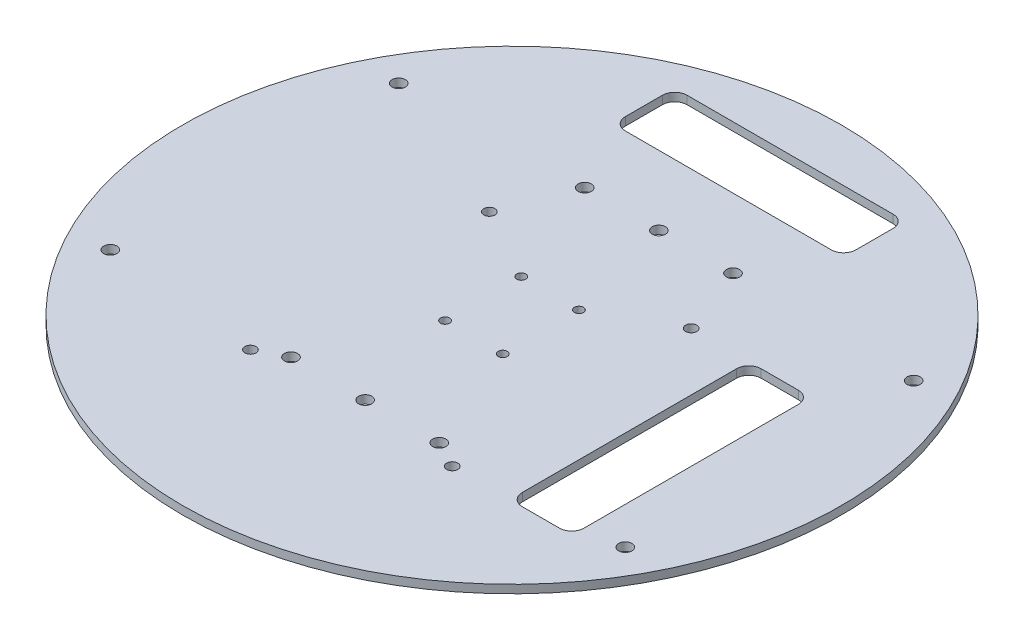
ISO-10303-21;
HEADER;
FILE_DESCRIPTION(('STEP AP214'),'2;1');
FILE_NAME('part.step','',(''),(''),'','','');
FILE_SCHEMA(('AUTOMOTIVE_DESIGN { 1 0 10303 214 1 1 1 1 }'));
ENDSEC;
DATA;
#1=APPLICATION_CONTEXT('core data for automotive mechanical design processes');
#2=APPLICATION_PROTOCOL_DEFINITION('international standard','automotive_design',2000,#1);
#3=PRODUCT_CONTEXT('',#1,'mechanical');
#4=PRODUCT('Part','Part','',(#3));
#5=PRODUCT_RELATED_PRODUCT_CATEGORY('part','',(#4));
#6=PRODUCT_DEFINITION_FORMATION('','',#4);
#7=PRODUCT_DEFINITION_CONTEXT('part definition',#1,'design');
#8=PRODUCT_DEFINITION('design','',#6,#7);
#9=PRODUCT_DEFINITION_SHAPE('','',#8);
#10=(LENGTH_UNIT() NAMED_UNIT(*) SI_UNIT(.MILLI.,.METRE.));
#11=(NAMED_UNIT(*) PLANE_ANGLE_UNIT() SI_UNIT($,.RADIAN.));
#12=(NAMED_UNIT(*) SI_UNIT($,.STERADIAN.) SOLID_ANGLE_UNIT());
#13=UNCERTAINTY_MEASURE_WITH_UNIT(LENGTH_MEASURE(1.E-05),#10,'distance_accuracy_value','');
#14=(GEOMETRIC_REPRESENTATION_CONTEXT(3) GLOBAL_UNCERTAINTY_ASSIGNED_CONTEXT((#13)) GLOBAL_UNIT_ASSIGNED_CONTEXT((#10,
#11,#12)) REPRESENTATION_CONTEXT('',''));
#15=CARTESIAN_POINT('',(0.,0.,0.));
#16=DIRECTION('',(0.,0.,1.));
#17=DIRECTION('',(1.,0.,0.));
#18=AXIS2_PLACEMENT_3D('',#15,#16,#17);
#19=CARTESIAN_POINT('',(0.,2.,0.));
#20=DIRECTION('',(0.,-1.,0.));
#21=DIRECTION('',(0.,0.,-1.));
#22=AXIS2_PLACEMENT_3D('',#19,#20,#21);
#23=CYLINDRICAL_SURFACE('',#22,80.);
#24=CARTESIAN_POINT('',(0.,2.,0.));
#25=DIRECTION('',(0.,1.,0.));
#26=DIRECTION('',(0.,0.,1.));
#27=AXIS2_PLACEMENT_3D('',#24,#25,#26);
#28=CIRCLE('',#27,80.);
#29=CARTESIAN_POINT('',(0.,2.,80.));
#30=VERTEX_POINT('',#29);
#31=EDGE_CURVE('E244',#30,#30,#28,.T.);
#32=ORIENTED_EDGE('',*,*,#31,.F.);
#33=EDGE_LOOP('',(#32));
#34=FACE_BOUND('',#33,.T.);
#35=CARTESIAN_POINT('',(0.,0.,0.));
#36=DIRECTION('',(0.,1.,0.));
#37=DIRECTION('',(0.,0.,1.));
#38=AXIS2_PLACEMENT_3D('',#35,#36,#37);
#39=CIRCLE('',#38,80.);
#40=CARTESIAN_POINT('',(0.,0.,80.));
#41=VERTEX_POINT('',#40);
#42=EDGE_CURVE('E240',#41,#41,#39,.T.);
#43=ORIENTED_EDGE('',*,*,#42,.T.);
#44=EDGE_LOOP('',(#43));
#45=FACE_BOUND('',#44,.T.);
#46=ADVANCED_FACE('F40',(#34,#45),#23,.T.);
#47=CARTESIAN_POINT('',(0.,2.,0.));
#48=DIRECTION('',(0.,1.,0.));
#49=DIRECTION('',(0.,0.,1.));
#50=AXIS2_PLACEMENT_3D('',#47,#48,#49);
#51=PLANE('',#50);
#52=CARTESIAN_POINT('',(-6.99999999999999,2.,9.25));
#53=DIRECTION('',(0.,1.,0.));
#54=DIRECTION('',(0.,0.,-1.));
#55=AXIS2_PLACEMENT_3D('',#52,#53,#54);
#56=CIRCLE('',#55,1.1);
#57=CARTESIAN_POINT('',(-6.99999999999999,2.,8.15));
#58=VERTEX_POINT('',#57);
#59=EDGE_CURVE('E575',#58,#58,#56,.T.);
#60=ORIENTED_EDGE('',*,*,#59,.F.);
#61=EDGE_LOOP('',(#60));
#62=FACE_BOUND('',#61,.T.);
#63=CARTESIAN_POINT('',(7.,2.,9.25));
#64=DIRECTION('',(0.,1.,0.));
#65=DIRECTION('',(0.,0.,-1.));
#66=AXIS2_PLACEMENT_3D('',#63,#64,#65);
#67=CIRCLE('',#66,1.1);
#68=CARTESIAN_POINT('',(7.,2.,8.15));
#69=VERTEX_POINT('',#68);
#70=EDGE_CURVE('E565',#69,#69,#67,.T.);
#71=ORIENTED_EDGE('',*,*,#70,.F.);
#72=EDGE_LOOP('',(#71));
#73=FACE_BOUND('',#72,.T.);
#74=CARTESIAN_POINT('',(7.,2.,-9.25));
#75=DIRECTION('',(0.,1.,0.));
#76=DIRECTION('',(0.,0.,1.));
#77=AXIS2_PLACEMENT_3D('',#74,#75,#76);
#78=CIRCLE('',#77,1.1);
#79=CARTESIAN_POINT('',(7.,2.,-8.15));
#80=VERTEX_POINT('',#79);
#81=EDGE_CURVE('E555',#80,#80,#78,.T.);
#82=ORIENTED_EDGE('',*,*,#81,.F.);
#83=EDGE_LOOP('',(#82));
#84=FACE_BOUND('',#83,.T.);
#85=CARTESIAN_POINT('',(-7.,2.,-9.25));
#86=DIRECTION('',(0.,1.,0.));
#87=DIRECTION('',(0.,0.,1.));
#88=AXIS2_PLACEMENT_3D('',#85,#86,#87);
#89=CIRCLE('',#88,1.1);
#90=CARTESIAN_POINT('',(-7.,2.,-8.15));
#91=VERTEX_POINT('',#90);
#92=EDGE_CURVE('E562',#91,#91,#89,.T.);
#93=ORIENTED_EDGE('',*,*,#92,.F.);
#94=EDGE_LOOP('',(#93));
#95=FACE_BOUND('',#94,.T.);
#96=CARTESIAN_POINT('',(-18.,2.,35.65));
#97=DIRECTION('',(0.,1.,0.));
#98=DIRECTION('',(0.,0.,-1.));
#99=AXIS2_PLACEMENT_3D('',#96,#97,#98);
#100=CIRCLE('',#99,1.6);
#101=CARTESIAN_POINT('',(-18.,2.,34.05));
#102=VERTEX_POINT('',#101);
#103=EDGE_CURVE('E583',#102,#102,#100,.T.);
#104=ORIENTED_EDGE('',*,*,#103,.F.);
#105=EDGE_LOOP('',(#104));
#106=FACE_BOUND('',#105,.T.);
#107=CARTESIAN_POINT('',(0.,2.,35.65));
#108=DIRECTION('',(0.,1.,0.));
#109=DIRECTION('',(0.,0.,-1.));
#110=AXIS2_PLACEMENT_3D('',#107,#108,#109);
#111=CIRCLE('',#110,1.6);
#112=CARTESIAN_POINT('',(0.,2.,34.05));
#113=VERTEX_POINT('',#112);
#114=EDGE_CURVE('E616',#113,#113,#111,.T.);
#115=ORIENTED_EDGE('',*,*,#114,.F.);
#116=EDGE_LOOP('',(#115));
#117=FACE_BOUND('',#116,.T.);
#118=CARTESIAN_POINT('',(18.,2.,35.65));
#119=DIRECTION('',(0.,1.,0.));
#120=DIRECTION('',(0.,0.,-1.));
#121=AXIS2_PLACEMENT_3D('',#118,#119,#120);
#122=CIRCLE('',#121,1.6);
#123=CARTESIAN_POINT('',(18.,2.,34.05));
#124=VERTEX_POINT('',#123);
#125=EDGE_CURVE('E608',#124,#124,#122,.T.);
#126=ORIENTED_EDGE('',*,*,#125,.F.);
#127=EDGE_LOOP('',(#126));
#128=FACE_BOUND('',#127,.T.);
#129=CARTESIAN_POINT('',(18.,2.,-35.65));
#130=DIRECTION('',(0.,1.,0.));
#131=DIRECTION('',(0.,0.,1.));
#132=AXIS2_PLACEMENT_3D('',#129,#130,#131);
#133=CIRCLE('',#132,1.6);
#134=CARTESIAN_POINT('',(18.,2.,-34.05));
#135=VERTEX_POINT('',#134);
#136=EDGE_CURVE('E600',#135,#135,#133,.T.);
#137=ORIENTED_EDGE('',*,*,#136,.F.);
#138=EDGE_LOOP('',(#137));
#139=FACE_BOUND('',#138,.T.);
#140=CARTESIAN_POINT('',(0.,2.,-35.65));
#141=DIRECTION('',(0.,1.,0.));
#142=DIRECTION('',(0.,0.,1.));
#143=AXIS2_PLACEMENT_3D('',#140,#141,#142);
#144=CIRCLE('',#143,1.6);
#145=CARTESIAN_POINT('',(0.,2.,-34.05));
#146=VERTEX_POINT('',#145);
#147=EDGE_CURVE('E592',#146,#146,#144,.T.);
#148=ORIENTED_EDGE('',*,*,#147,.F.);
#149=EDGE_LOOP('',(#148));
#150=FACE_BOUND('',#149,.T.);
#151=CARTESIAN_POINT('',(-18.,2.,-35.65));
#152=DIRECTION('',(0.,1.,0.));
#153=DIRECTION('',(0.,0.,1.));
#154=AXIS2_PLACEMENT_3D('',#151,#152,#153);
#155=CIRCLE('',#154,1.6);
#156=CARTESIAN_POINT('',(-18.,2.,-34.05));
#157=VERTEX_POINT('',#156);
#158=EDGE_CURVE('E591',#157,#157,#155,.T.);
#159=ORIENTED_EDGE('',*,*,#158,.F.);
#160=EDGE_LOOP('',(#159));
#161=FACE_BOUND('',#160,.T.);
#162=DIRECTION('',(0.,0.,1.));
#163=VECTOR('',#162,1.);
#164=CARTESIAN_POINT('',(38.5,2.,-19.));
#165=LINE('',#164,#163);
#166=CARTESIAN_POINT('',(38.5,2.,-16.));
#167=VERTEX_POINT('',#166);
#168=CARTESIAN_POINT('',(38.5,2.,36.));
#169=VERTEX_POINT('',#168);
#170=EDGE_CURVE('E187',#167,#169,#165,.T.);
#171=ORIENTED_EDGE('',*,*,#170,.F.);
#172=CARTESIAN_POINT('',(41.5,2.,-16.));
#173=DIRECTION('',(0.,1.,0.));
#174=DIRECTION('',(0.,0.,1.));
#175=AXIS2_PLACEMENT_3D('',#172,#173,#174);
#176=CIRCLE('',#175,3.);
#177=CARTESIAN_POINT('',(41.5,2.,-19.));
#178=VERTEX_POINT('',#177);
#179=EDGE_CURVE('E311',#167,#178,#176,.F.);
#180=ORIENTED_EDGE('',*,*,#179,.T.);
#181=DIRECTION('',(-1.,0.,0.));
#182=VECTOR('',#181,1.);
#183=CARTESIAN_POINT('',(38.5,2.,-19.));
#184=LINE('',#183,#182);
#185=CARTESIAN_POINT('',(50.5,2.,-19.));
#186=VERTEX_POINT('',#185);
#187=EDGE_CURVE('E192',#186,#178,#184,.T.);
#188=ORIENTED_EDGE('',*,*,#187,.F.);
#189=CARTESIAN_POINT('',(50.5,2.,-16.));
#190=DIRECTION('',(0.,1.,0.));
#191=DIRECTION('',(0.,0.,1.));
#192=AXIS2_PLACEMENT_3D('',#189,#190,#191);
#193=CIRCLE('',#192,3.);
#194=CARTESIAN_POINT('',(53.5,2.,-16.));
#195=VERTEX_POINT('',#194);
#196=EDGE_CURVE('E305',#186,#195,#193,.F.);
#197=ORIENTED_EDGE('',*,*,#196,.T.);
#198=DIRECTION('',(0.,0.,-1.));
#199=VECTOR('',#198,1.);
#200=CARTESIAN_POINT('',(53.5,2.,-19.));
#201=LINE('',#200,#199);
#202=CARTESIAN_POINT('',(53.5,2.,36.));
#203=VERTEX_POINT('',#202);
#204=EDGE_CURVE('E186',#203,#195,#201,.T.);
#205=ORIENTED_EDGE('',*,*,#204,.F.);
#206=CARTESIAN_POINT('',(50.5,2.,36.));
#207=DIRECTION('',(0.,1.,0.));
#208=DIRECTION('',(0.,0.,1.));
#209=AXIS2_PLACEMENT_3D('',#206,#207,#208);
#210=CIRCLE('',#209,3.);
#211=CARTESIAN_POINT('',(50.5,2.,39.));
#212=VERTEX_POINT('',#211);
#213=EDGE_CURVE('E184',#203,#212,#210,.F.);
#214=ORIENTED_EDGE('',*,*,#213,.T.);
#215=DIRECTION('',(1.,0.,0.));
#216=VECTOR('',#215,1.);
#217=CARTESIAN_POINT('',(38.5,2.,39.));
#218=LINE('',#217,#216);
#219=CARTESIAN_POINT('',(41.5,2.,39.));
#220=VERTEX_POINT('',#219);
#221=EDGE_CURVE('E173',#220,#212,#218,.T.);
#222=ORIENTED_EDGE('',*,*,#221,.F.);
#223=CARTESIAN_POINT('',(41.5,2.,36.));
#224=DIRECTION('',(0.,1.,0.));
#225=DIRECTION('',(0.,0.,1.));
#226=AXIS2_PLACEMENT_3D('',#223,#224,#225);
#227=CIRCLE('',#226,3.);
#228=EDGE_CURVE('E155',#220,#169,#227,.F.);
#229=ORIENTED_EDGE('',*,*,#228,.T.);
#230=EDGE_LOOP('',(#171,#180,#188,#197,#205,#214,#222,#229));
#231=FACE_BOUND('',#230,.T.);
#232=CARTESIAN_POINT('',(-24.5,2.,-19.));
#233=DIRECTION('',(0.,1.,0.));
#234=DIRECTION('',(0.,0.,1.));
#235=AXIS2_PLACEMENT_3D('',#232,#233,#234);
#236=CIRCLE('',#235,1.35);
#237=CARTESIAN_POINT('',(-24.5,2.,-17.65));
#238=VERTEX_POINT('',#237);
#239=EDGE_CURVE('E386',#238,#238,#236,.T.);
#240=ORIENTED_EDGE('',*,*,#239,.F.);
#241=EDGE_LOOP('',(#240));
#242=FACE_BOUND('',#241,.T.);
#243=CARTESIAN_POINT('',(24.5,2.,39.));
#244=DIRECTION('',(0.,1.,0.));
#245=DIRECTION('',(0.,0.,-1.));
#246=AXIS2_PLACEMENT_3D('',#243,#244,#245);
#247=CIRCLE('',#246,1.35000000000002);
#248=CARTESIAN_POINT('',(24.5,2.,37.65));
#249=VERTEX_POINT('',#248);
#250=EDGE_CURVE('E394',#249,#249,#247,.T.);
#251=ORIENTED_EDGE('',*,*,#250,.F.);
#252=EDGE_LOOP('',(#251));
#253=FACE_BOUND('',#252,.T.);
#254=CARTESIAN_POINT('',(24.5,2.,-19.));
#255=DIRECTION('',(0.,1.,0.));
#256=DIRECTION('',(0.,0.,-1.));
#257=AXIS2_PLACEMENT_3D('',#254,#255,#256);
#258=CIRCLE('',#257,1.35000000000024);
#259=CARTESIAN_POINT('',(24.5,2.,-20.3500000000002));
#260=VERTEX_POINT('',#259);
#261=EDGE_CURVE('E361',#260,#260,#258,.T.);
#262=ORIENTED_EDGE('',*,*,#261,.F.);
#263=EDGE_LOOP('',(#262));
#264=FACE_BOUND('',#263,.T.);
#265=DIRECTION('',(0.,0.,1.));
#266=VECTOR('',#265,1.);
#267=CARTESIAN_POINT('',(-28.,2.,-67.5));
#268=LINE('',#267,#266);
#269=CARTESIAN_POINT('',(-28.,2.,-64.5));
#270=VERTEX_POINT('',#269);
#271=CARTESIAN_POINT('',(-28.,2.,-55.5));
#272=VERTEX_POINT('',#271);
#273=EDGE_CURVE('E372',#270,#272,#268,.T.);
#274=ORIENTED_EDGE('',*,*,#273,.F.);
#275=CARTESIAN_POINT('',(-25.,2.,-64.5));
#276=DIRECTION('',(0.,1.,0.));
#277=DIRECTION('',(0.,0.,1.));
#278=AXIS2_PLACEMENT_3D('',#275,#276,#277);
#279=CIRCLE('',#278,3.);
#280=CARTESIAN_POINT('',(-25.,2.,-67.5));
#281=VERTEX_POINT('',#280);
#282=EDGE_CURVE('E323',#270,#281,#279,.F.);
#283=ORIENTED_EDGE('',*,*,#282,.T.);
#284=DIRECTION('',(-1.,0.,0.));
#285=VECTOR('',#284,1.);
#286=CARTESIAN_POINT('',(-28.,2.,-67.5));
#287=LINE('',#286,#285);
#288=CARTESIAN_POINT('',(25.,2.,-67.5));
#289=VERTEX_POINT('',#288);
#290=EDGE_CURVE('E341',#289,#281,#287,.T.);
#291=ORIENTED_EDGE('',*,*,#290,.F.);
#292=CARTESIAN_POINT('',(25.,2.,-64.5));
#293=DIRECTION('',(0.,1.,0.));
#294=DIRECTION('',(0.,0.,1.));
#295=AXIS2_PLACEMENT_3D('',#292,#293,#294);
#296=CIRCLE('',#295,3.);
#297=CARTESIAN_POINT('',(28.,2.,-64.5));
#298=VERTEX_POINT('',#297);
#299=EDGE_CURVE('E49',#289,#298,#296,.F.);
#300=ORIENTED_EDGE('',*,*,#299,.T.);
#301=DIRECTION('',(0.,0.,-1.));
#302=VECTOR('',#301,1.);
#303=CARTESIAN_POINT('',(28.,2.,-67.5));
#304=LINE('',#303,#302);
#305=CARTESIAN_POINT('',(28.,2.,-55.5));
#306=VERTEX_POINT('',#305);
#307=EDGE_CURVE('E339',#306,#298,#304,.T.);
#308=ORIENTED_EDGE('',*,*,#307,.F.);
#309=CARTESIAN_POINT('',(25.,2.,-55.5));
#310=DIRECTION('',(0.,1.,0.));
#311=DIRECTION('',(0.,0.,1.));
#312=AXIS2_PLACEMENT_3D('',#309,#310,#311);
#313=CIRCLE('',#312,3.);
#314=CARTESIAN_POINT('',(25.,2.,-52.5));
#315=VERTEX_POINT('',#314);
#316=EDGE_CURVE('E329',#306,#315,#313,.F.);
#317=ORIENTED_EDGE('',*,*,#316,.T.);
#318=DIRECTION('',(1.,0.,0.));
#319=VECTOR('',#318,1.);
#320=CARTESIAN_POINT('',(-28.,2.,-52.5));
#321=LINE('',#320,#319);
#322=CARTESIAN_POINT('',(-25.,2.,-52.5));
#323=VERTEX_POINT('',#322);
#324=EDGE_CURVE('E347',#323,#315,#321,.T.);
#325=ORIENTED_EDGE('',*,*,#324,.F.);
#326=CARTESIAN_POINT('',(-25.,2.,-55.5));
#327=DIRECTION('',(0.,1.,0.));
#328=DIRECTION('',(0.,0.,1.));
#329=AXIS2_PLACEMENT_3D('',#326,#327,#328);
#330=CIRCLE('',#329,3.);
#331=EDGE_CURVE('E317',#323,#272,#330,.F.);
#332=ORIENTED_EDGE('',*,*,#331,.T.);
#333=EDGE_LOOP('',(#274,#283,#291,#300,#308,#317,#325,#332));
#334=FACE_BOUND('',#333,.T.);
#335=CARTESIAN_POINT('',(-24.5,2.,39.));
#336=DIRECTION('',(0.,1.,0.));
#337=DIRECTION('',(0.,0.,1.));
#338=AXIS2_PLACEMENT_3D('',#335,#336,#337);
#339=CIRCLE('',#338,1.35);
#340=CARTESIAN_POINT('',(-24.5,2.,40.35));
#341=VERTEX_POINT('',#340);
#342=EDGE_CURVE('E207',#341,#341,#339,.T.);
#343=ORIENTED_EDGE('',*,*,#342,.F.);
#344=EDGE_LOOP('',(#343));
#345=FACE_BOUND('',#344,.T.);
#346=CARTESIAN_POINT('',(62.5,2.,-35.));
#347=DIRECTION('',(0.,1.,0.));
#348=DIRECTION('',(0.,0.,-1.));
#349=AXIS2_PLACEMENT_3D('',#346,#347,#348);
#350=CIRCLE('',#349,1.59999999999994);
#351=CARTESIAN_POINT('',(62.5,2.,-36.6));
#352=VERTEX_POINT('',#351);
#353=EDGE_CURVE('E206',#352,#352,#350,.T.);
#354=ORIENTED_EDGE('',*,*,#353,.F.);
#355=EDGE_LOOP('',(#354));
#356=FACE_BOUND('',#355,.T.);
#357=CARTESIAN_POINT('',(62.5,2.,35.));
#358=DIRECTION('',(0.,1.,0.));
#359=DIRECTION('',(0.,0.,-1.));
#360=AXIS2_PLACEMENT_3D('',#357,#358,#359);
#361=CIRCLE('',#360,1.59999999999995);
#362=CARTESIAN_POINT('',(62.5,2.,33.4));
#363=VERTEX_POINT('',#362);
#364=EDGE_CURVE('E225',#363,#363,#361,.T.);
#365=ORIENTED_EDGE('',*,*,#364,.F.);
#366=EDGE_LOOP('',(#365));
#367=FACE_BOUND('',#366,.T.);
#368=CARTESIAN_POINT('',(-62.5,2.,35.));
#369=DIRECTION('',(0.,1.,0.));
#370=DIRECTION('',(0.,0.,1.));
#371=AXIS2_PLACEMENT_3D('',#368,#369,#370);
#372=CIRCLE('',#371,1.6);
#373=CARTESIAN_POINT('',(-62.5,2.,36.6));
#374=VERTEX_POINT('',#373);
#375=EDGE_CURVE('E217',#374,#374,#372,.T.);
#376=ORIENTED_EDGE('',*,*,#375,.F.);
#377=EDGE_LOOP('',(#376));
#378=FACE_BOUND('',#377,.T.);
#379=CARTESIAN_POINT('',(-62.5,2.,-35.));
#380=DIRECTION('',(0.,1.,0.));
#381=DIRECTION('',(0.,0.,1.));
#382=AXIS2_PLACEMENT_3D('',#379,#380,#381);
#383=CIRCLE('',#382,1.6);
#384=CARTESIAN_POINT('',(-62.5,2.,-33.4));
#385=VERTEX_POINT('',#384);
#386=EDGE_CURVE('E216',#385,#385,#383,.T.);
#387=ORIENTED_EDGE('',*,*,#386,.F.);
#388=EDGE_LOOP('',(#387));
#389=FACE_BOUND('',#388,.T.);
#390=ORIENTED_EDGE('',*,*,#31,.T.);
#391=EDGE_LOOP('',(#390));
#392=FACE_BOUND('',#391,.T.);
#393=ADVANCED_FACE('F181',(#62,#73,#84,#95,#106,#117,#128,#139,#150,#161,#231,#242,#253,#264,
#334,#345,#356,#367,#378,#389,#392),#51,.T.);
#394=CARTESIAN_POINT('',(0.,0.,0.));
#395=DIRECTION('',(0.,1.,0.));
#396=DIRECTION('',(0.,0.,1.));
#397=AXIS2_PLACEMENT_3D('',#394,#395,#396);
#398=PLANE('',#397);
#399=CARTESIAN_POINT('',(-6.99999999999999,0.,9.25));
#400=DIRECTION('',(0.,1.,0.));
#401=DIRECTION('',(0.,0.,-1.));
#402=AXIS2_PLACEMENT_3D('',#399,#400,#401);
#403=CIRCLE('',#402,1.1);
#404=CARTESIAN_POINT('',(-6.99999999999999,0.,8.15));
#405=VERTEX_POINT('',#404);
#406=EDGE_CURVE('E571',#405,#405,#403,.T.);
#407=ORIENTED_EDGE('',*,*,#406,.T.);
#408=EDGE_LOOP('',(#407));
#409=FACE_BOUND('',#408,.T.);
#410=CARTESIAN_POINT('',(7.,0.,9.25));
#411=DIRECTION('',(0.,1.,0.));
#412=DIRECTION('',(0.,0.,-1.));
#413=AXIS2_PLACEMENT_3D('',#410,#411,#412);
#414=CIRCLE('',#413,1.1);
#415=CARTESIAN_POINT('',(7.,0.,8.15));
#416=VERTEX_POINT('',#415);
#417=EDGE_CURVE('E558',#416,#416,#414,.T.);
#418=ORIENTED_EDGE('',*,*,#417,.T.);
#419=EDGE_LOOP('',(#418));
#420=FACE_BOUND('',#419,.T.);
#421=CARTESIAN_POINT('',(7.,0.,-9.25));
#422=DIRECTION('',(0.,1.,0.));
#423=DIRECTION('',(0.,0.,1.));
#424=AXIS2_PLACEMENT_3D('',#421,#422,#423);
#425=CIRCLE('',#424,1.1);
#426=CARTESIAN_POINT('',(7.,0.,-8.15));
#427=VERTEX_POINT('',#426);
#428=EDGE_CURVE('E552',#427,#427,#425,.T.);
#429=ORIENTED_EDGE('',*,*,#428,.T.);
#430=EDGE_LOOP('',(#429));
#431=FACE_BOUND('',#430,.T.);
#432=CARTESIAN_POINT('',(-7.,0.,-9.25));
#433=DIRECTION('',(0.,1.,0.));
#434=DIRECTION('',(0.,0.,1.));
#435=AXIS2_PLACEMENT_3D('',#432,#433,#434);
#436=CIRCLE('',#435,1.1);
#437=CARTESIAN_POINT('',(-7.,0.,-8.15));
#438=VERTEX_POINT('',#437);
#439=EDGE_CURVE('E579',#438,#438,#436,.T.);
#440=ORIENTED_EDGE('',*,*,#439,.T.);
#441=EDGE_LOOP('',(#440));
#442=FACE_BOUND('',#441,.T.);
#443=CARTESIAN_POINT('',(-18.,0.,35.65));
#444=DIRECTION('',(0.,1.,0.));
#445=DIRECTION('',(0.,0.,-1.));
#446=AXIS2_PLACEMENT_3D('',#443,#444,#445);
#447=CIRCLE('',#446,1.6);
#448=CARTESIAN_POINT('',(-18.,0.,34.05));
#449=VERTEX_POINT('',#448);
#450=EDGE_CURVE('E620',#449,#449,#447,.T.);
#451=ORIENTED_EDGE('',*,*,#450,.T.);
#452=EDGE_LOOP('',(#451));
#453=FACE_BOUND('',#452,.T.);
#454=CARTESIAN_POINT('',(0.,0.,35.65));
#455=DIRECTION('',(0.,1.,0.));
#456=DIRECTION('',(0.,0.,-1.));
#457=AXIS2_PLACEMENT_3D('',#454,#455,#456);
#458=CIRCLE('',#457,1.6);
#459=CARTESIAN_POINT('',(0.,0.,34.05));
#460=VERTEX_POINT('',#459);
#461=EDGE_CURVE('E612',#460,#460,#458,.T.);
#462=ORIENTED_EDGE('',*,*,#461,.T.);
#463=EDGE_LOOP('',(#462));
#464=FACE_BOUND('',#463,.T.);
#465=CARTESIAN_POINT('',(18.,0.,35.65));
#466=DIRECTION('',(0.,1.,0.));
#467=DIRECTION('',(0.,0.,-1.));
#468=AXIS2_PLACEMENT_3D('',#465,#466,#467);
#469=CIRCLE('',#468,1.6);
#470=CARTESIAN_POINT('',(18.,0.,34.05));
#471=VERTEX_POINT('',#470);
#472=EDGE_CURVE('E604',#471,#471,#469,.T.);
#473=ORIENTED_EDGE('',*,*,#472,.T.);
#474=EDGE_LOOP('',(#473));
#475=FACE_BOUND('',#474,.T.);
#476=CARTESIAN_POINT('',(18.,0.,-35.65));
#477=DIRECTION('',(0.,1.,0.));
#478=DIRECTION('',(0.,0.,1.));
#479=AXIS2_PLACEMENT_3D('',#476,#477,#478);
#480=CIRCLE('',#479,1.6);
#481=CARTESIAN_POINT('',(18.,0.,-34.05));
#482=VERTEX_POINT('',#481);
#483=EDGE_CURVE('E596',#482,#482,#480,.T.);
#484=ORIENTED_EDGE('',*,*,#483,.T.);
#485=EDGE_LOOP('',(#484));
#486=FACE_BOUND('',#485,.T.);
#487=CARTESIAN_POINT('',(0.,0.,-35.65));
#488=DIRECTION('',(0.,1.,0.));
#489=DIRECTION('',(0.,0.,1.));
#490=AXIS2_PLACEMENT_3D('',#487,#488,#489);
#491=CIRCLE('',#490,1.6);
#492=CARTESIAN_POINT('',(0.,0.,-34.05));
#493=VERTEX_POINT('',#492);
#494=EDGE_CURVE('E587',#493,#493,#491,.T.);
#495=ORIENTED_EDGE('',*,*,#494,.T.);
#496=EDGE_LOOP('',(#495));
#497=FACE_BOUND('',#496,.T.);
#498=CARTESIAN_POINT('',(-18.,0.,-35.65));
#499=DIRECTION('',(0.,1.,0.));
#500=DIRECTION('',(0.,0.,1.));
#501=AXIS2_PLACEMENT_3D('',#498,#499,#500);
#502=CIRCLE('',#501,1.6);
#503=CARTESIAN_POINT('',(-18.,0.,-34.05));
#504=VERTEX_POINT('',#503);
#505=EDGE_CURVE('E194',#504,#504,#502,.T.);
#506=ORIENTED_EDGE('',*,*,#505,.T.);
#507=EDGE_LOOP('',(#506));
#508=FACE_BOUND('',#507,.T.);
#509=DIRECTION('',(0.,0.,-1.));
#510=VECTOR('',#509,1.);
#511=CARTESIAN_POINT('',(53.5,0.,-19.));
#512=LINE('',#511,#510);
#513=CARTESIAN_POINT('',(53.5,0.,36.));
#514=VERTEX_POINT('',#513);
#515=CARTESIAN_POINT('',(53.5,0.,-16.));
#516=VERTEX_POINT('',#515);
#517=EDGE_CURVE('E403',#514,#516,#512,.T.);
#518=ORIENTED_EDGE('',*,*,#517,.T.);
#519=CARTESIAN_POINT('',(50.5,0.,-16.));
#520=DIRECTION('',(0.,1.,0.));
#521=DIRECTION('',(0.,0.,1.));
#522=AXIS2_PLACEMENT_3D('',#519,#520,#521);
#523=CIRCLE('',#522,3.);
#524=CARTESIAN_POINT('',(50.5,0.,-19.));
#525=VERTEX_POINT('',#524);
#526=EDGE_CURVE('E308',#516,#525,#523,.T.);
#527=ORIENTED_EDGE('',*,*,#526,.T.);
#528=DIRECTION('',(-1.,0.,0.));
#529=VECTOR('',#528,1.);
#530=CARTESIAN_POINT('',(38.5,0.,-19.));
#531=LINE('',#530,#529);
#532=CARTESIAN_POINT('',(41.5,0.,-19.));
#533=VERTEX_POINT('',#532);
#534=EDGE_CURVE('E376',#525,#533,#531,.T.);
#535=ORIENTED_EDGE('',*,*,#534,.T.);
#536=CARTESIAN_POINT('',(41.5,0.,-16.));
#537=DIRECTION('',(0.,1.,0.));
#538=DIRECTION('',(0.,0.,1.));
#539=AXIS2_PLACEMENT_3D('',#536,#537,#538);
#540=CIRCLE('',#539,3.);
#541=CARTESIAN_POINT('',(38.5,0.,-16.));
#542=VERTEX_POINT('',#541);
#543=EDGE_CURVE('E314',#533,#542,#540,.T.);
#544=ORIENTED_EDGE('',*,*,#543,.T.);
#545=DIRECTION('',(0.,0.,1.));
#546=VECTOR('',#545,1.);
#547=CARTESIAN_POINT('',(38.5,0.,-19.));
#548=LINE('',#547,#546);
#549=CARTESIAN_POINT('',(38.5,0.,36.));
#550=VERTEX_POINT('',#549);
#551=EDGE_CURVE('E201',#542,#550,#548,.T.);
#552=ORIENTED_EDGE('',*,*,#551,.T.);
#553=CARTESIAN_POINT('',(41.5,0.,36.));
#554=DIRECTION('',(0.,1.,0.));
#555=DIRECTION('',(0.,0.,1.));
#556=AXIS2_PLACEMENT_3D('',#553,#554,#555);
#557=CIRCLE('',#556,3.);
#558=CARTESIAN_POINT('',(41.5,0.,39.));
#559=VERTEX_POINT('',#558);
#560=EDGE_CURVE('E166',#550,#559,#557,.T.);
#561=ORIENTED_EDGE('',*,*,#560,.T.);
#562=DIRECTION('',(1.,0.,0.));
#563=VECTOR('',#562,1.);
#564=CARTESIAN_POINT('',(38.5,0.,39.));
#565=LINE('',#564,#563);
#566=CARTESIAN_POINT('',(50.5,0.,39.));
#567=VERTEX_POINT('',#566);
#568=EDGE_CURVE('E176',#559,#567,#565,.T.);
#569=ORIENTED_EDGE('',*,*,#568,.T.);
#570=CARTESIAN_POINT('',(50.5,0.,36.));
#571=DIRECTION('',(0.,1.,0.));
#572=DIRECTION('',(0.,0.,1.));
#573=AXIS2_PLACEMENT_3D('',#570,#571,#572);
#574=CIRCLE('',#573,3.);
#575=EDGE_CURVE('E302',#567,#514,#574,.T.);
#576=ORIENTED_EDGE('',*,*,#575,.T.);
#577=EDGE_LOOP('',(#518,#527,#535,#544,#552,#561,#569,#576));
#578=FACE_BOUND('',#577,.T.);
#579=CARTESIAN_POINT('',(-24.5,0.,-19.));
#580=DIRECTION('',(0.,1.,0.));
#581=DIRECTION('',(0.,0.,1.));
#582=AXIS2_PLACEMENT_3D('',#579,#580,#581);
#583=CIRCLE('',#582,1.35);
#584=CARTESIAN_POINT('',(-24.5,0.,-17.65));
#585=VERTEX_POINT('',#584);
#586=EDGE_CURVE('E211',#585,#585,#583,.T.);
#587=ORIENTED_EDGE('',*,*,#586,.T.);
#588=EDGE_LOOP('',(#587));
#589=FACE_BOUND('',#588,.T.);
#590=CARTESIAN_POINT('',(24.5,0.,39.));
#591=DIRECTION('',(0.,1.,0.));
#592=DIRECTION('',(0.,0.,-1.));
#593=AXIS2_PLACEMENT_3D('',#590,#591,#592);
#594=CIRCLE('',#593,1.35000000000002);
#595=CARTESIAN_POINT('',(24.5,0.,37.65));
#596=VERTEX_POINT('',#595);
#597=EDGE_CURVE('E390',#596,#596,#594,.T.);
#598=ORIENTED_EDGE('',*,*,#597,.T.);
#599=EDGE_LOOP('',(#598));
#600=FACE_BOUND('',#599,.T.);
#601=CARTESIAN_POINT('',(24.5,0.,-19.));
#602=DIRECTION('',(0.,1.,0.));
#603=DIRECTION('',(0.,0.,-1.));
#604=AXIS2_PLACEMENT_3D('',#601,#602,#603);
#605=CIRCLE('',#604,1.35000000000024);
#606=CARTESIAN_POINT('',(24.5,0.,-20.3500000000002));
#607=VERTEX_POINT('',#606);
#608=EDGE_CURVE('E366',#607,#607,#605,.T.);
#609=ORIENTED_EDGE('',*,*,#608,.T.);
#610=EDGE_LOOP('',(#609));
#611=FACE_BOUND('',#610,.T.);
#612=DIRECTION('',(0.,0.,-1.));
#613=VECTOR('',#612,1.);
#614=CARTESIAN_POINT('',(28.,0.,-67.5));
#615=LINE('',#614,#613);
#616=CARTESIAN_POINT('',(28.,0.,-55.5));
#617=VERTEX_POINT('',#616);
#618=CARTESIAN_POINT('',(28.,0.,-64.5));
#619=VERTEX_POINT('',#618);
#620=EDGE_CURVE('E356',#617,#619,#615,.T.);
#621=ORIENTED_EDGE('',*,*,#620,.T.);
#622=CARTESIAN_POINT('',(25.,0.,-64.5));
#623=DIRECTION('',(0.,1.,0.));
#624=DIRECTION('',(0.,0.,1.));
#625=AXIS2_PLACEMENT_3D('',#622,#623,#624);
#626=CIRCLE('',#625,3.);
#627=CARTESIAN_POINT('',(25.,0.,-67.5));
#628=VERTEX_POINT('',#627);
#629=EDGE_CURVE('E11',#619,#628,#626,.T.);
#630=ORIENTED_EDGE('',*,*,#629,.T.);
#631=DIRECTION('',(-1.,0.,0.));
#632=VECTOR('',#631,1.);
#633=CARTESIAN_POINT('',(-28.,0.,-67.5));
#634=LINE('',#633,#632);
#635=CARTESIAN_POINT('',(-25.,0.,-67.5));
#636=VERTEX_POINT('',#635);
#637=EDGE_CURVE('E354',#628,#636,#634,.T.);
#638=ORIENTED_EDGE('',*,*,#637,.T.);
#639=CARTESIAN_POINT('',(-25.,0.,-64.5));
#640=DIRECTION('',(0.,1.,0.));
#641=DIRECTION('',(0.,0.,1.));
#642=AXIS2_PLACEMENT_3D('',#639,#640,#641);
#643=CIRCLE('',#642,3.);
#644=CARTESIAN_POINT('',(-28.,0.,-64.5));
#645=VERTEX_POINT('',#644);
#646=EDGE_CURVE('E326',#636,#645,#643,.T.);
#647=ORIENTED_EDGE('',*,*,#646,.T.);
#648=DIRECTION('',(0.,0.,1.));
#649=VECTOR('',#648,1.);
#650=CARTESIAN_POINT('',(-28.,0.,-67.5));
#651=LINE('',#650,#649);
#652=CARTESIAN_POINT('',(-28.,0.,-55.5));
#653=VERTEX_POINT('',#652);
#654=EDGE_CURVE('E382',#645,#653,#651,.T.);
#655=ORIENTED_EDGE('',*,*,#654,.T.);
#656=CARTESIAN_POINT('',(-25.,0.,-55.5));
#657=DIRECTION('',(0.,1.,0.));
#658=DIRECTION('',(0.,0.,1.));
#659=AXIS2_PLACEMENT_3D('',#656,#657,#658);
#660=CIRCLE('',#659,3.);
#661=CARTESIAN_POINT('',(-25.,0.,-52.5));
#662=VERTEX_POINT('',#661);
#663=EDGE_CURVE('E320',#653,#662,#660,.T.);
#664=ORIENTED_EDGE('',*,*,#663,.T.);
#665=DIRECTION('',(1.,0.,0.));
#666=VECTOR('',#665,1.);
#667=CARTESIAN_POINT('',(-28.,0.,-52.5));
#668=LINE('',#667,#666);
#669=CARTESIAN_POINT('',(25.,0.,-52.5));
#670=VERTEX_POINT('',#669);
#671=EDGE_CURVE('E368',#662,#670,#668,.T.);
#672=ORIENTED_EDGE('',*,*,#671,.T.);
#673=CARTESIAN_POINT('',(25.,0.,-55.5));
#674=DIRECTION('',(0.,1.,0.));
#675=DIRECTION('',(0.,0.,1.));
#676=AXIS2_PLACEMENT_3D('',#673,#674,#675);
#677=CIRCLE('',#676,3.);
#678=EDGE_CURVE('E63',#670,#617,#677,.T.);
#679=ORIENTED_EDGE('',*,*,#678,.T.);
#680=EDGE_LOOP('',(#621,#630,#638,#647,#655,#664,#672,#679));
#681=FACE_BOUND('',#680,.T.);
#682=CARTESIAN_POINT('',(-24.5,0.,39.));
#683=DIRECTION('',(0.,1.,0.));
#684=DIRECTION('',(0.,0.,1.));
#685=AXIS2_PLACEMENT_3D('',#682,#683,#684);
#686=CIRCLE('',#685,1.35);
#687=CARTESIAN_POINT('',(-24.5,0.,40.35));
#688=VERTEX_POINT('',#687);
#689=EDGE_CURVE('E202',#688,#688,#686,.T.);
#690=ORIENTED_EDGE('',*,*,#689,.T.);
#691=EDGE_LOOP('',(#690));
#692=FACE_BOUND('',#691,.T.);
#693=CARTESIAN_POINT('',(62.5,0.,-35.));
#694=DIRECTION('',(0.,1.,0.));
#695=DIRECTION('',(0.,0.,-1.));
#696=AXIS2_PLACEMENT_3D('',#693,#694,#695);
#697=CIRCLE('',#696,1.59999999999994);
#698=CARTESIAN_POINT('',(62.5,0.,-36.6));
#699=VERTEX_POINT('',#698);
#700=EDGE_CURVE('E229',#699,#699,#697,.T.);
#701=ORIENTED_EDGE('',*,*,#700,.T.);
#702=EDGE_LOOP('',(#701));
#703=FACE_BOUND('',#702,.T.);
#704=CARTESIAN_POINT('',(62.5,0.,35.));
#705=DIRECTION('',(0.,1.,0.));
#706=DIRECTION('',(0.,0.,-1.));
#707=AXIS2_PLACEMENT_3D('',#704,#705,#706);
#708=CIRCLE('',#707,1.59999999999995);
#709=CARTESIAN_POINT('',(62.5,0.,33.4));
#710=VERTEX_POINT('',#709);
#711=EDGE_CURVE('E221',#710,#710,#708,.T.);
#712=ORIENTED_EDGE('',*,*,#711,.T.);
#713=EDGE_LOOP('',(#712));
#714=FACE_BOUND('',#713,.T.);
#715=CARTESIAN_POINT('',(-62.5,0.,35.));
#716=DIRECTION('',(0.,1.,0.));
#717=DIRECTION('',(0.,0.,1.));
#718=AXIS2_PLACEMENT_3D('',#715,#716,#717);
#719=CIRCLE('',#718,1.6);
#720=CARTESIAN_POINT('',(-62.5,0.,36.6));
#721=VERTEX_POINT('',#720);
#722=EDGE_CURVE('E212',#721,#721,#719,.T.);
#723=ORIENTED_EDGE('',*,*,#722,.T.);
#724=EDGE_LOOP('',(#723));
#725=FACE_BOUND('',#724,.T.);
#726=CARTESIAN_POINT('',(-62.5,0.,-35.));
#727=DIRECTION('',(0.,1.,0.));
#728=DIRECTION('',(0.,0.,1.));
#729=AXIS2_PLACEMENT_3D('',#726,#727,#728);
#730=CIRCLE('',#729,1.6);
#731=CARTESIAN_POINT('',(-62.5,0.,-33.4));
#732=VERTEX_POINT('',#731);
#733=EDGE_CURVE('E236',#732,#732,#730,.T.);
#734=ORIENTED_EDGE('',*,*,#733,.T.);
#735=EDGE_LOOP('',(#734));
#736=FACE_BOUND('',#735,.T.);
#737=ORIENTED_EDGE('',*,*,#42,.F.);
#738=EDGE_LOOP('',(#737));
#739=FACE_BOUND('',#738,.T.);
#740=ADVANCED_FACE('F352',(#409,#420,#431,#442,#453,#464,#475,#486,#497,#508,#578,#589,#600,
#611,#681,#692,#703,#714,#725,#736,#739),#398,.F.);
#741=CARTESIAN_POINT('',(-62.5,0.,-35.));
#742=DIRECTION('',(0.,1.,0.));
#743=DIRECTION('',(0.,0.,1.));
#744=AXIS2_PLACEMENT_3D('',#741,#742,#743);
#745=CYLINDRICAL_SURFACE('',#744,1.6);
#746=ORIENTED_EDGE('',*,*,#733,.F.);
#747=EDGE_LOOP('',(#746));
#748=FACE_BOUND('',#747,.T.);
#749=ORIENTED_EDGE('',*,*,#386,.T.);
#750=EDGE_LOOP('',(#749));
#751=FACE_BOUND('',#750,.T.);
#752=ADVANCED_FACE('F455',(#748,#751),#745,.F.);
#753=CARTESIAN_POINT('',(-62.5,0.,35.));
#754=DIRECTION('',(0.,1.,0.));
#755=DIRECTION('',(0.,0.,1.));
#756=AXIS2_PLACEMENT_3D('',#753,#754,#755);
#757=CYLINDRICAL_SURFACE('',#756,1.6);
#758=ORIENTED_EDGE('',*,*,#722,.F.);
#759=EDGE_LOOP('',(#758));
#760=FACE_BOUND('',#759,.T.);
#761=ORIENTED_EDGE('',*,*,#375,.T.);
#762=EDGE_LOOP('',(#761));
#763=FACE_BOUND('',#762,.T.);
#764=ADVANCED_FACE('F460',(#760,#763),#757,.F.);
#765=CARTESIAN_POINT('',(62.5,0.,35.));
#766=DIRECTION('',(0.,1.,0.));
#767=DIRECTION('',(0.,0.,1.));
#768=AXIS2_PLACEMENT_3D('',#765,#766,#767);
#769=CYLINDRICAL_SURFACE('',#768,1.59999999999995);
#770=ORIENTED_EDGE('',*,*,#711,.F.);
#771=EDGE_LOOP('',(#770));
#772=FACE_BOUND('',#771,.T.);
#773=ORIENTED_EDGE('',*,*,#364,.T.);
#774=EDGE_LOOP('',(#773));
#775=FACE_BOUND('',#774,.T.);
#776=ADVANCED_FACE('F466',(#772,#775),#769,.F.);
#777=CARTESIAN_POINT('',(62.5,0.,-35.));
#778=DIRECTION('',(0.,1.,0.));
#779=DIRECTION('',(0.,0.,1.));
#780=AXIS2_PLACEMENT_3D('',#777,#778,#779);
#781=CYLINDRICAL_SURFACE('',#780,1.59999999999994);
#782=ORIENTED_EDGE('',*,*,#700,.F.);
#783=EDGE_LOOP('',(#782));
#784=FACE_BOUND('',#783,.T.);
#785=ORIENTED_EDGE('',*,*,#353,.T.);
#786=EDGE_LOOP('',(#785));
#787=FACE_BOUND('',#786,.T.);
#788=ADVANCED_FACE('F462',(#784,#787),#781,.F.);
#789=CARTESIAN_POINT('',(-24.5,0.,39.));
#790=DIRECTION('',(0.,1.,0.));
#791=DIRECTION('',(0.,0.,1.));
#792=AXIS2_PLACEMENT_3D('',#789,#790,#791);
#793=CYLINDRICAL_SURFACE('',#792,1.35);
#794=ORIENTED_EDGE('',*,*,#689,.F.);
#795=EDGE_LOOP('',(#794));
#796=FACE_BOUND('',#795,.T.);
#797=ORIENTED_EDGE('',*,*,#342,.T.);
#798=EDGE_LOOP('',(#797));
#799=FACE_BOUND('',#798,.T.);
#800=ADVANCED_FACE('F465',(#796,#799),#793,.F.);
#801=CARTESIAN_POINT('',(-28.,0.,-67.5));
#802=DIRECTION('',(-1.,0.,0.));
#803=DIRECTION('',(0.,0.,1.));
#804=AXIS2_PLACEMENT_3D('',#801,#802,#803);
#805=PLANE('',#804);
#806=ORIENTED_EDGE('',*,*,#273,.T.);
#807=DIRECTION('',(0.,1.,0.));
#808=VECTOR('',#807,1.);
#809=CARTESIAN_POINT('',(-28.,0.,-55.5));
#810=LINE('',#809,#808);
#811=EDGE_CURVE('E283',#272,#653,#810,.F.);
#812=ORIENTED_EDGE('',*,*,#811,.T.);
#813=ORIENTED_EDGE('',*,*,#654,.F.);
#814=DIRECTION('',(0.,1.,0.));
#815=VECTOR('',#814,1.);
#816=CARTESIAN_POINT('',(-28.,2.,-64.5));
#817=LINE('',#816,#815);
#818=EDGE_CURVE('E279',#645,#270,#817,.T.);
#819=ORIENTED_EDGE('',*,*,#818,.T.);
#820=EDGE_LOOP('',(#806,#812,#813,#819));
#821=FACE_BOUND('',#820,.T.);
#822=ADVANCED_FACE('F476',(#821),#805,.F.);
#823=CARTESIAN_POINT('',(-28.,0.,-67.5));
#824=DIRECTION('',(0.,0.,-1.));
#825=DIRECTION('',(-1.,0.,0.));
#826=AXIS2_PLACEMENT_3D('',#823,#824,#825);
#827=PLANE('',#826);
#828=ORIENTED_EDGE('',*,*,#290,.T.);
#829=DIRECTION('',(0.,1.,0.));
#830=VECTOR('',#829,1.);
#831=CARTESIAN_POINT('',(-25.,0.,-67.5));
#832=LINE('',#831,#830);
#833=EDGE_CURVE('E290',#281,#636,#832,.F.);
#834=ORIENTED_EDGE('',*,*,#833,.T.);
#835=ORIENTED_EDGE('',*,*,#637,.F.);
#836=DIRECTION('',(0.,1.,0.));
#837=VECTOR('',#836,1.);
#838=CARTESIAN_POINT('',(25.,2.,-67.5));
#839=LINE('',#838,#837);
#840=EDGE_CURVE('E286',#628,#289,#839,.T.);
#841=ORIENTED_EDGE('',*,*,#840,.T.);
#842=EDGE_LOOP('',(#828,#834,#835,#841));
#843=FACE_BOUND('',#842,.T.);
#844=ADVANCED_FACE('F358',(#843),#827,.F.);
#845=CARTESIAN_POINT('',(28.,0.,-67.5));
#846=DIRECTION('',(1.,0.,0.));
#847=DIRECTION('',(0.,0.,-1.));
#848=AXIS2_PLACEMENT_3D('',#845,#846,#847);
#849=PLANE('',#848);
#850=ORIENTED_EDGE('',*,*,#620,.F.);
#851=DIRECTION('',(0.,1.,0.));
#852=VECTOR('',#851,1.);
#853=CARTESIAN_POINT('',(28.,2.,-55.5));
#854=LINE('',#853,#852);
#855=EDGE_CURVE('E167',#617,#306,#854,.T.);
#856=ORIENTED_EDGE('',*,*,#855,.T.);
#857=ORIENTED_EDGE('',*,*,#307,.T.);
#858=DIRECTION('',(0.,1.,0.));
#859=VECTOR('',#858,1.);
#860=CARTESIAN_POINT('',(28.,0.,-64.5));
#861=LINE('',#860,#859);
#862=EDGE_CURVE('E56',#298,#619,#861,.F.);
#863=ORIENTED_EDGE('',*,*,#862,.T.);
#864=EDGE_LOOP('',(#850,#856,#857,#863));
#865=FACE_BOUND('',#864,.T.);
#866=ADVANCED_FACE('F344',(#865),#849,.F.);
#867=CARTESIAN_POINT('',(-28.,0.,-52.5));
#868=DIRECTION('',(0.,0.,1.));
#869=DIRECTION('',(1.,0.,0.));
#870=AXIS2_PLACEMENT_3D('',#867,#868,#869);
#871=PLANE('',#870);
#872=ORIENTED_EDGE('',*,*,#671,.F.);
#873=DIRECTION('',(0.,1.,0.));
#874=VECTOR('',#873,1.);
#875=CARTESIAN_POINT('',(-25.,2.,-52.5));
#876=LINE('',#875,#874);
#877=EDGE_CURVE('E275',#662,#323,#876,.T.);
#878=ORIENTED_EDGE('',*,*,#877,.T.);
#879=ORIENTED_EDGE('',*,*,#324,.T.);
#880=DIRECTION('',(0.,1.,0.));
#881=VECTOR('',#880,1.);
#882=CARTESIAN_POINT('',(25.,0.,-52.5));
#883=LINE('',#882,#881);
#884=EDGE_CURVE('E272',#315,#670,#883,.F.);
#885=ORIENTED_EDGE('',*,*,#884,.T.);
#886=EDGE_LOOP('',(#872,#878,#879,#885));
#887=FACE_BOUND('',#886,.T.);
#888=ADVANCED_FACE('F499',(#887),#871,.F.);
#889=CARTESIAN_POINT('',(24.5,0.,-19.));
#890=DIRECTION('',(0.,1.,0.));
#891=DIRECTION('',(0.,0.,1.));
#892=AXIS2_PLACEMENT_3D('',#889,#890,#891);
#893=CYLINDRICAL_SURFACE('',#892,1.35000000000024);
#894=ORIENTED_EDGE('',*,*,#608,.F.);
#895=EDGE_LOOP('',(#894));
#896=FACE_BOUND('',#895,.T.);
#897=ORIENTED_EDGE('',*,*,#261,.T.);
#898=EDGE_LOOP('',(#897));
#899=FACE_BOUND('',#898,.T.);
#900=ADVANCED_FACE('F491',(#896,#899),#893,.F.);
#901=CARTESIAN_POINT('',(24.5,0.,39.));
#902=DIRECTION('',(0.,1.,0.));
#903=DIRECTION('',(0.,0.,1.));
#904=AXIS2_PLACEMENT_3D('',#901,#902,#903);
#905=CYLINDRICAL_SURFACE('',#904,1.35000000000002);
#906=ORIENTED_EDGE('',*,*,#597,.F.);
#907=EDGE_LOOP('',(#906));
#908=FACE_BOUND('',#907,.T.);
#909=ORIENTED_EDGE('',*,*,#250,.T.);
#910=EDGE_LOOP('',(#909));
#911=FACE_BOUND('',#910,.T.);
#912=ADVANCED_FACE('F488',(#908,#911),#905,.F.);
#913=CARTESIAN_POINT('',(-24.5,0.,-19.));
#914=DIRECTION('',(0.,1.,0.));
#915=DIRECTION('',(0.,0.,1.));
#916=AXIS2_PLACEMENT_3D('',#913,#914,#915);
#917=CYLINDRICAL_SURFACE('',#916,1.35);
#918=ORIENTED_EDGE('',*,*,#586,.F.);
#919=EDGE_LOOP('',(#918));
#920=FACE_BOUND('',#919,.T.);
#921=ORIENTED_EDGE('',*,*,#239,.T.);
#922=EDGE_LOOP('',(#921));
#923=FACE_BOUND('',#922,.T.);
#924=ADVANCED_FACE('F480',(#920,#923),#917,.F.);
#925=CARTESIAN_POINT('',(38.5,0.,-19.));
#926=DIRECTION('',(-1.,0.,0.));
#927=DIRECTION('',(0.,0.,1.));
#928=AXIS2_PLACEMENT_3D('',#925,#926,#927);
#929=PLANE('',#928);
#930=ORIENTED_EDGE('',*,*,#170,.T.);
#931=DIRECTION('',(0.,1.,0.));
#932=VECTOR('',#931,1.);
#933=CARTESIAN_POINT('',(38.5,0.,36.));
#934=LINE('',#933,#932);
#935=EDGE_CURVE('E160',#169,#550,#934,.F.);
#936=ORIENTED_EDGE('',*,*,#935,.T.);
#937=ORIENTED_EDGE('',*,*,#551,.F.);
#938=DIRECTION('',(0.,1.,0.));
#939=VECTOR('',#938,1.);
#940=CARTESIAN_POINT('',(38.5,2.,-16.));
#941=LINE('',#940,#939);
#942=EDGE_CURVE('E178',#542,#167,#941,.T.);
#943=ORIENTED_EDGE('',*,*,#942,.T.);
#944=EDGE_LOOP('',(#930,#936,#937,#943));
#945=FACE_BOUND('',#944,.T.);
#946=ADVANCED_FACE('F421',(#945),#929,.F.);
#947=CARTESIAN_POINT('',(38.5,0.,-19.));
#948=DIRECTION('',(0.,0.,-1.));
#949=DIRECTION('',(-1.,0.,0.));
#950=AXIS2_PLACEMENT_3D('',#947,#948,#949);
#951=PLANE('',#950);
#952=ORIENTED_EDGE('',*,*,#534,.F.);
#953=DIRECTION('',(0.,1.,0.));
#954=VECTOR('',#953,1.);
#955=CARTESIAN_POINT('',(50.5,2.,-19.));
#956=LINE('',#955,#954);
#957=EDGE_CURVE('E268',#525,#186,#956,.T.);
#958=ORIENTED_EDGE('',*,*,#957,.T.);
#959=ORIENTED_EDGE('',*,*,#187,.T.);
#960=DIRECTION('',(0.,1.,0.));
#961=VECTOR('',#960,1.);
#962=CARTESIAN_POINT('',(41.5,0.,-19.));
#963=LINE('',#962,#961);
#964=EDGE_CURVE('E265',#178,#533,#963,.F.);
#965=ORIENTED_EDGE('',*,*,#964,.T.);
#966=EDGE_LOOP('',(#952,#958,#959,#965));
#967=FACE_BOUND('',#966,.T.);
#968=ADVANCED_FACE('F423',(#967),#951,.F.);
#969=CARTESIAN_POINT('',(53.5,0.,-19.));
#970=DIRECTION('',(1.,0.,0.));
#971=DIRECTION('',(0.,0.,-1.));
#972=AXIS2_PLACEMENT_3D('',#969,#970,#971);
#973=PLANE('',#972);
#974=ORIENTED_EDGE('',*,*,#517,.F.);
#975=DIRECTION('',(0.,1.,0.));
#976=VECTOR('',#975,1.);
#977=CARTESIAN_POINT('',(53.5,2.,36.));
#978=LINE('',#977,#976);
#979=EDGE_CURVE('E261',#514,#203,#978,.T.);
#980=ORIENTED_EDGE('',*,*,#979,.T.);
#981=ORIENTED_EDGE('',*,*,#204,.T.);
#982=DIRECTION('',(0.,1.,0.));
#983=VECTOR('',#982,1.);
#984=CARTESIAN_POINT('',(53.5,0.,-16.));
#985=LINE('',#984,#983);
#986=EDGE_CURVE('E258',#195,#516,#985,.F.);
#987=ORIENTED_EDGE('',*,*,#986,.T.);
#988=EDGE_LOOP('',(#974,#980,#981,#987));
#989=FACE_BOUND('',#988,.T.);
#990=ADVANCED_FACE('F429',(#989),#973,.F.);
#991=CARTESIAN_POINT('',(38.5,0.,39.));
#992=DIRECTION('',(0.,0.,1.));
#993=DIRECTION('',(1.,0.,0.));
#994=AXIS2_PLACEMENT_3D('',#991,#992,#993);
#995=PLANE('',#994);
#996=ORIENTED_EDGE('',*,*,#568,.F.);
#997=DIRECTION('',(0.,1.,0.));
#998=VECTOR('',#997,1.);
#999=CARTESIAN_POINT('',(41.5,2.,39.));
#1000=LINE('',#999,#998);
#1001=EDGE_CURVE('E159',#559,#220,#1000,.T.);
#1002=ORIENTED_EDGE('',*,*,#1001,.T.);
#1003=ORIENTED_EDGE('',*,*,#221,.T.);
#1004=DIRECTION('',(0.,1.,0.));
#1005=VECTOR('',#1004,1.);
#1006=CARTESIAN_POINT('',(50.5,0.,39.));
#1007=LINE('',#1006,#1005);
#1008=EDGE_CURVE('E179',#212,#567,#1007,.F.);
#1009=ORIENTED_EDGE('',*,*,#1008,.T.);
#1010=EDGE_LOOP('',(#996,#1002,#1003,#1009));
#1011=FACE_BOUND('',#1010,.T.);
#1012=ADVANCED_FACE('F172',(#1011),#995,.F.);
#1013=CARTESIAN_POINT('',(-18.,0.,-35.65));
#1014=DIRECTION('',(0.,1.,0.));
#1015=DIRECTION('',(0.,0.,1.));
#1016=AXIS2_PLACEMENT_3D('',#1013,#1014,#1015);
#1017=CYLINDRICAL_SURFACE('',#1016,1.6);
#1018=ORIENTED_EDGE('',*,*,#505,.F.);
#1019=EDGE_LOOP('',(#1018));
#1020=FACE_BOUND('',#1019,.T.);
#1021=ORIENTED_EDGE('',*,*,#158,.T.);
#1022=EDGE_LOOP('',(#1021));
#1023=FACE_BOUND('',#1022,.T.);
#1024=ADVANCED_FACE('F483',(#1020,#1023),#1017,.F.);
#1025=CARTESIAN_POINT('',(0.,0.,-35.65));
#1026=DIRECTION('',(0.,1.,0.));
#1027=DIRECTION('',(0.,0.,1.));
#1028=AXIS2_PLACEMENT_3D('',#1025,#1026,#1027);
#1029=CYLINDRICAL_SURFACE('',#1028,1.6);
#1030=ORIENTED_EDGE('',*,*,#494,.F.);
#1031=EDGE_LOOP('',(#1030));
#1032=FACE_BOUND('',#1031,.T.);
#1033=ORIENTED_EDGE('',*,*,#147,.T.);
#1034=EDGE_LOOP('',(#1033));
#1035=FACE_BOUND('',#1034,.T.);
#1036=ADVANCED_FACE('F512',(#1032,#1035),#1029,.F.);
#1037=CARTESIAN_POINT('',(18.,0.,-35.65));
#1038=DIRECTION('',(0.,1.,0.));
#1039=DIRECTION('',(0.,0.,1.));
#1040=AXIS2_PLACEMENT_3D('',#1037,#1038,#1039);
#1041=CYLINDRICAL_SURFACE('',#1040,1.6);
#1042=ORIENTED_EDGE('',*,*,#483,.F.);
#1043=EDGE_LOOP('',(#1042));
#1044=FACE_BOUND('',#1043,.T.);
#1045=ORIENTED_EDGE('',*,*,#136,.T.);
#1046=EDGE_LOOP('',(#1045));
#1047=FACE_BOUND('',#1046,.T.);
#1048=ADVANCED_FACE('F526',(#1044,#1047),#1041,.F.);
#1049=CARTESIAN_POINT('',(18.,0.,35.65));
#1050=DIRECTION('',(0.,1.,0.));
#1051=DIRECTION('',(0.,0.,1.));
#1052=AXIS2_PLACEMENT_3D('',#1049,#1050,#1051);
#1053=CYLINDRICAL_SURFACE('',#1052,1.6);
#1054=ORIENTED_EDGE('',*,*,#472,.F.);
#1055=EDGE_LOOP('',(#1054));
#1056=FACE_BOUND('',#1055,.T.);
#1057=ORIENTED_EDGE('',*,*,#125,.T.);
#1058=EDGE_LOOP('',(#1057));
#1059=FACE_BOUND('',#1058,.T.);
#1060=ADVANCED_FACE('F522',(#1056,#1059),#1053,.F.);
#1061=CARTESIAN_POINT('',(0.,0.,35.65));
#1062=DIRECTION('',(0.,1.,0.));
#1063=DIRECTION('',(0.,0.,1.));
#1064=AXIS2_PLACEMENT_3D('',#1061,#1062,#1063);
#1065=CYLINDRICAL_SURFACE('',#1064,1.6);
#1066=ORIENTED_EDGE('',*,*,#461,.F.);
#1067=EDGE_LOOP('',(#1066));
#1068=FACE_BOUND('',#1067,.T.);
#1069=ORIENTED_EDGE('',*,*,#114,.T.);
#1070=EDGE_LOOP('',(#1069));
#1071=FACE_BOUND('',#1070,.T.);
#1072=ADVANCED_FACE('F518',(#1068,#1071),#1065,.F.);
#1073=CARTESIAN_POINT('',(-18.,0.,35.65));
#1074=DIRECTION('',(0.,1.,0.));
#1075=DIRECTION('',(0.,0.,1.));
#1076=AXIS2_PLACEMENT_3D('',#1073,#1074,#1075);
#1077=CYLINDRICAL_SURFACE('',#1076,1.6);
#1078=ORIENTED_EDGE('',*,*,#450,.F.);
#1079=EDGE_LOOP('',(#1078));
#1080=FACE_BOUND('',#1079,.T.);
#1081=ORIENTED_EDGE('',*,*,#103,.T.);
#1082=EDGE_LOOP('',(#1081));
#1083=FACE_BOUND('',#1082,.T.);
#1084=ADVANCED_FACE('F514',(#1080,#1083),#1077,.F.);
#1085=CARTESIAN_POINT('',(-7.,0.,-9.25));
#1086=DIRECTION('',(0.,1.,0.));
#1087=DIRECTION('',(0.,0.,1.));
#1088=AXIS2_PLACEMENT_3D('',#1085,#1086,#1087);
#1089=CYLINDRICAL_SURFACE('',#1088,1.1);
#1090=ORIENTED_EDGE('',*,*,#439,.F.);
#1091=EDGE_LOOP('',(#1090));
#1092=FACE_BOUND('',#1091,.T.);
#1093=ORIENTED_EDGE('',*,*,#92,.T.);
#1094=EDGE_LOOP('',(#1093));
#1095=FACE_BOUND('',#1094,.T.);
#1096=ADVANCED_FACE('F517',(#1092,#1095),#1089,.F.);
#1097=CARTESIAN_POINT('',(7.,0.,-9.25));
#1098=DIRECTION('',(0.,1.,0.));
#1099=DIRECTION('',(0.,0.,1.));
#1100=AXIS2_PLACEMENT_3D('',#1097,#1098,#1099);
#1101=CYLINDRICAL_SURFACE('',#1100,1.1);
#1102=ORIENTED_EDGE('',*,*,#428,.F.);
#1103=EDGE_LOOP('',(#1102));
#1104=FACE_BOUND('',#1103,.T.);
#1105=ORIENTED_EDGE('',*,*,#81,.T.);
#1106=EDGE_LOOP('',(#1105));
#1107=FACE_BOUND('',#1106,.T.);
#1108=ADVANCED_FACE('F536',(#1104,#1107),#1101,.F.);
#1109=CARTESIAN_POINT('',(7.,0.,9.25));
#1110=DIRECTION('',(0.,1.,0.));
#1111=DIRECTION('',(0.,0.,1.));
#1112=AXIS2_PLACEMENT_3D('',#1109,#1110,#1111);
#1113=CYLINDRICAL_SURFACE('',#1112,1.1);
#1114=ORIENTED_EDGE('',*,*,#417,.F.);
#1115=EDGE_LOOP('',(#1114));
#1116=FACE_BOUND('',#1115,.T.);
#1117=ORIENTED_EDGE('',*,*,#70,.T.);
#1118=EDGE_LOOP('',(#1117));
#1119=FACE_BOUND('',#1118,.T.);
#1120=ADVANCED_FACE('F540',(#1116,#1119),#1113,.F.);
#1121=CARTESIAN_POINT('',(-6.99999999999999,0.,9.25));
#1122=DIRECTION('',(0.,1.,0.));
#1123=DIRECTION('',(0.,0.,1.));
#1124=AXIS2_PLACEMENT_3D('',#1121,#1122,#1123);
#1125=CYLINDRICAL_SURFACE('',#1124,1.1);
#1126=ORIENTED_EDGE('',*,*,#406,.F.);
#1127=EDGE_LOOP('',(#1126));
#1128=FACE_BOUND('',#1127,.T.);
#1129=ORIENTED_EDGE('',*,*,#59,.T.);
#1130=EDGE_LOOP('',(#1129));
#1131=FACE_BOUND('',#1130,.T.);
#1132=ADVANCED_FACE('F441',(#1128,#1131),#1125,.F.);
#1133=CARTESIAN_POINT('',(41.5,0.,36.));
#1134=DIRECTION('',(0.,-1.,0.));
#1135=DIRECTION('',(0.,0.,-1.));
#1136=AXIS2_PLACEMENT_3D('',#1133,#1134,#1135);
#1137=CYLINDRICAL_SURFACE('',#1136,3.);
#1138=ORIENTED_EDGE('',*,*,#560,.F.);
#1139=ORIENTED_EDGE('',*,*,#935,.F.);
#1140=ORIENTED_EDGE('',*,*,#228,.F.);
#1141=ORIENTED_EDGE('',*,*,#1001,.F.);
#1142=EDGE_LOOP('',(#1138,#1139,#1140,#1141));
#1143=FACE_BOUND('',#1142,.T.);
#1144=ADVANCED_FACE('F158',(#1143),#1137,.F.);
#1145=CARTESIAN_POINT('',(50.5,0.,36.));
#1146=DIRECTION('',(0.,-1.,0.));
#1147=DIRECTION('',(0.,0.,-1.));
#1148=AXIS2_PLACEMENT_3D('',#1145,#1146,#1147);
#1149=CYLINDRICAL_SURFACE('',#1148,3.);
#1150=ORIENTED_EDGE('',*,*,#575,.F.);
#1151=ORIENTED_EDGE('',*,*,#1008,.F.);
#1152=ORIENTED_EDGE('',*,*,#213,.F.);
#1153=ORIENTED_EDGE('',*,*,#979,.F.);
#1154=EDGE_LOOP('',(#1150,#1151,#1152,#1153));
#1155=FACE_BOUND('',#1154,.T.);
#1156=ADVANCED_FACE('F433',(#1155),#1149,.F.);
#1157=CARTESIAN_POINT('',(50.5,0.,-16.));
#1158=DIRECTION('',(0.,-1.,0.));
#1159=DIRECTION('',(0.,0.,-1.));
#1160=AXIS2_PLACEMENT_3D('',#1157,#1158,#1159);
#1161=CYLINDRICAL_SURFACE('',#1160,3.);
#1162=ORIENTED_EDGE('',*,*,#526,.F.);
#1163=ORIENTED_EDGE('',*,*,#986,.F.);
#1164=ORIENTED_EDGE('',*,*,#196,.F.);
#1165=ORIENTED_EDGE('',*,*,#957,.F.);
#1166=EDGE_LOOP('',(#1162,#1163,#1164,#1165));
#1167=FACE_BOUND('',#1166,.T.);
#1168=ADVANCED_FACE('F425',(#1167),#1161,.F.);
#1169=CARTESIAN_POINT('',(41.5,0.,-16.));
#1170=DIRECTION('',(0.,-1.,0.));
#1171=DIRECTION('',(0.,0.,-1.));
#1172=AXIS2_PLACEMENT_3D('',#1169,#1170,#1171);
#1173=CYLINDRICAL_SURFACE('',#1172,3.);
#1174=ORIENTED_EDGE('',*,*,#543,.F.);
#1175=ORIENTED_EDGE('',*,*,#964,.F.);
#1176=ORIENTED_EDGE('',*,*,#179,.F.);
#1177=ORIENTED_EDGE('',*,*,#942,.F.);
#1178=EDGE_LOOP('',(#1174,#1175,#1176,#1177));
#1179=FACE_BOUND('',#1178,.T.);
#1180=ADVANCED_FACE('F419',(#1179),#1173,.F.);
#1181=CARTESIAN_POINT('',(-25.,0.,-55.5));
#1182=DIRECTION('',(0.,-1.,0.));
#1183=DIRECTION('',(0.,0.,-1.));
#1184=AXIS2_PLACEMENT_3D('',#1181,#1182,#1183);
#1185=CYLINDRICAL_SURFACE('',#1184,3.);
#1186=ORIENTED_EDGE('',*,*,#663,.F.);
#1187=ORIENTED_EDGE('',*,*,#811,.F.);
#1188=ORIENTED_EDGE('',*,*,#331,.F.);
#1189=ORIENTED_EDGE('',*,*,#877,.F.);
#1190=EDGE_LOOP('',(#1186,#1187,#1188,#1189));
#1191=FACE_BOUND('',#1190,.T.);
#1192=ADVANCED_FACE('F647',(#1191),#1185,.F.);
#1193=CARTESIAN_POINT('',(-25.,0.,-64.5));
#1194=DIRECTION('',(0.,-1.,0.));
#1195=DIRECTION('',(0.,0.,-1.));
#1196=AXIS2_PLACEMENT_3D('',#1193,#1194,#1195);
#1197=CYLINDRICAL_SURFACE('',#1196,3.);
#1198=ORIENTED_EDGE('',*,*,#646,.F.);
#1199=ORIENTED_EDGE('',*,*,#833,.F.);
#1200=ORIENTED_EDGE('',*,*,#282,.F.);
#1201=ORIENTED_EDGE('',*,*,#818,.F.);
#1202=EDGE_LOOP('',(#1198,#1199,#1200,#1201));
#1203=FACE_BOUND('',#1202,.T.);
#1204=ADVANCED_FACE('F652',(#1203),#1197,.F.);
#1205=CARTESIAN_POINT('',(25.,0.,-55.5));
#1206=DIRECTION('',(0.,-1.,0.));
#1207=DIRECTION('',(0.,0.,-1.));
#1208=AXIS2_PLACEMENT_3D('',#1205,#1206,#1207);
#1209=CYLINDRICAL_SURFACE('',#1208,3.);
#1210=ORIENTED_EDGE('',*,*,#678,.F.);
#1211=ORIENTED_EDGE('',*,*,#884,.F.);
#1212=ORIENTED_EDGE('',*,*,#316,.F.);
#1213=ORIENTED_EDGE('',*,*,#855,.F.);
#1214=EDGE_LOOP('',(#1210,#1211,#1212,#1213));
#1215=FACE_BOUND('',#1214,.T.);
#1216=ADVANCED_FACE('F644',(#1215),#1209,.F.);
#1217=CARTESIAN_POINT('',(25.,0.,-64.5));
#1218=DIRECTION('',(0.,-1.,0.));
#1219=DIRECTION('',(0.,0.,-1.));
#1220=AXIS2_PLACEMENT_3D('',#1217,#1218,#1219);
#1221=CYLINDRICAL_SURFACE('',#1220,3.);
#1222=ORIENTED_EDGE('',*,*,#629,.F.);
#1223=ORIENTED_EDGE('',*,*,#862,.F.);
#1224=ORIENTED_EDGE('',*,*,#299,.F.);
#1225=ORIENTED_EDGE('',*,*,#840,.F.);
#1226=EDGE_LOOP('',(#1222,#1223,#1224,#1225));
#1227=FACE_BOUND('',#1226,.T.);
#1228=ADVANCED_FACE('F42',(#1227),#1221,.F.);
#1229=CLOSED_SHELL('',(#46,#393,#740,#752,#764,#776,#788,#800,#822,#844,#866,#888,#900,#912,
#924,#946,#968,#990,#1012,#1024,#1036,#1048,#1060,#1072,#1084,#1096,#1108,#1120,#1132,#1144,
#1156,#1168,#1180,#1192,#1204,#1216,#1228));
#1230=MANIFOLD_SOLID_BREP('B2',#1229);
#1231=ADVANCED_BREP_SHAPE_REPRESENTATION('',(#18,#1230),#14);
#1232=SHAPE_DEFINITION_REPRESENTATION(#9,#1231);
ENDSEC;
END-ISO-10303-21;
